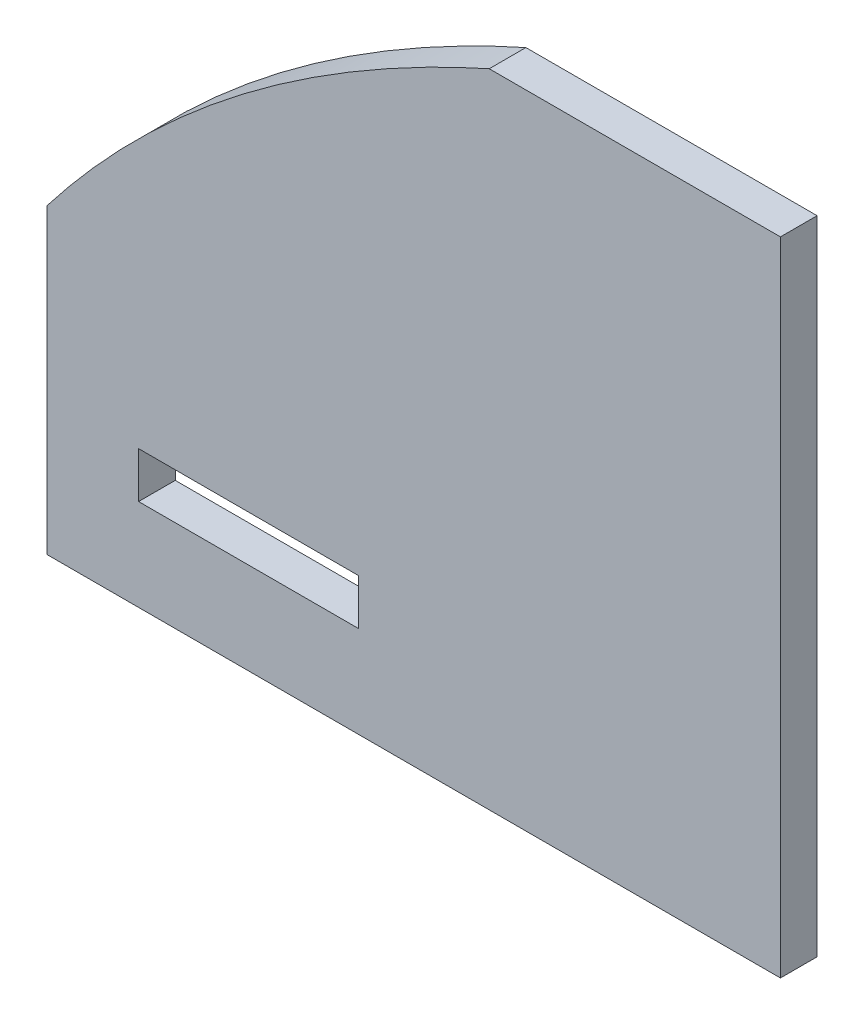
ISO-10303-21;
HEADER;
FILE_DESCRIPTION(('STEP AP214'),'2;1');
FILE_NAME('part.step','',(''),(''),'','','');
FILE_SCHEMA(('AUTOMOTIVE_DESIGN { 1 0 10303 214 1 1 1 1 }'));
ENDSEC;
DATA;
#1=APPLICATION_CONTEXT('core data for automotive mechanical design processes');
#2=APPLICATION_PROTOCOL_DEFINITION('international standard','automotive_design',2000,#1);
#3=PRODUCT_CONTEXT('',#1,'mechanical');
#4=PRODUCT('Part','Part','',(#3));
#5=PRODUCT_RELATED_PRODUCT_CATEGORY('part','',(#4));
#6=PRODUCT_DEFINITION_FORMATION('','',#4);
#7=PRODUCT_DEFINITION_CONTEXT('part definition',#1,'design');
#8=PRODUCT_DEFINITION('design','',#6,#7);
#9=PRODUCT_DEFINITION_SHAPE('','',#8);
#10=(LENGTH_UNIT() NAMED_UNIT(*) SI_UNIT(.MILLI.,.METRE.));
#11=(NAMED_UNIT(*) PLANE_ANGLE_UNIT() SI_UNIT($,.RADIAN.));
#12=(NAMED_UNIT(*) SI_UNIT($,.STERADIAN.) SOLID_ANGLE_UNIT());
#13=UNCERTAINTY_MEASURE_WITH_UNIT(LENGTH_MEASURE(1.E-05),#10,'distance_accuracy_value','');
#14=(GEOMETRIC_REPRESENTATION_CONTEXT(3) GLOBAL_UNCERTAINTY_ASSIGNED_CONTEXT((#13)) GLOBAL_UNIT_ASSIGNED_CONTEXT((#10,
#11,#12)) REPRESENTATION_CONTEXT('',''));
#15=CARTESIAN_POINT('',(0.,0.,0.));
#16=DIRECTION('',(0.,0.,1.));
#17=DIRECTION('',(1.,0.,0.));
#18=AXIS2_PLACEMENT_3D('',#15,#16,#17);
#19=CARTESIAN_POINT('',(0.,0.,2.));
#20=DIRECTION('',(0.,0.,-1.));
#21=DIRECTION('',(-1.,0.,0.));
#22=AXIS2_PLACEMENT_3D('',#19,#20,#21);
#23=PLANE('',#22);
#24=DIRECTION('',(-1.,0.,0.));
#25=VECTOR('',#24,1.);
#26=CARTESIAN_POINT('',(-20.,17.5,2.));
#27=LINE('',#26,#25);
#28=CARTESIAN_POINT('',(20.,17.5,2.));
#29=VERTEX_POINT('',#28);
#30=CARTESIAN_POINT('',(4.11999999999999,17.5,2.));
#31=VERTEX_POINT('',#30);
#32=EDGE_CURVE('E113',#29,#31,#27,.T.);
#33=ORIENTED_EDGE('',*,*,#32,.T.);
#34=CARTESIAN_POINT('',(-28.9974094779595,-17.6239337785056,2.));
#35=CARTESIAN_POINT('',(-20.2355041142434,6.58937083623082,2.));
#36=CARTESIAN_POINT('',(4.11999999999999,17.5,2.));
#37=B_SPLINE_CURVE_WITH_KNOTS('',2,(#34,#35,#36),.UNSPECIFIED.,.F.,.F.,(3,3),(0.,1.),.UNSPECIFIED.);
#38=CARTESIAN_POINT('',(-20.0000000003059,-1.030000000397,2.));
#39=VERTEX_POINT('',#38);
#40=EDGE_CURVE('E101',#39,#31,#37,.T.);
#41=ORIENTED_EDGE('',*,*,#40,.F.);
#42=DIRECTION('',(0.,-1.,0.));
#43=VECTOR('',#42,1.);
#44=CARTESIAN_POINT('',(-20.,-17.5,2.));
#45=LINE('',#44,#43);
#46=CARTESIAN_POINT('',(-20.,-17.5,2.));
#47=VERTEX_POINT('',#46);
#48=EDGE_CURVE('E121',#39,#47,#45,.T.);
#49=ORIENTED_EDGE('',*,*,#48,.T.);
#50=DIRECTION('',(1.,0.,0.));
#51=VECTOR('',#50,1.);
#52=CARTESIAN_POINT('',(-20.,-17.5,2.));
#53=LINE('',#52,#51);
#54=CARTESIAN_POINT('',(20.,-17.5,2.));
#55=VERTEX_POINT('',#54);
#56=EDGE_CURVE('E123',#47,#55,#53,.T.);
#57=ORIENTED_EDGE('',*,*,#56,.T.);
#58=DIRECTION('',(0.,1.,0.));
#59=VECTOR('',#58,1.);
#60=CARTESIAN_POINT('',(20.,-17.5,2.));
#61=LINE('',#60,#59);
#62=EDGE_CURVE('E119',#55,#29,#61,.T.);
#63=ORIENTED_EDGE('',*,*,#62,.T.);
#64=EDGE_LOOP('',(#33,#41,#49,#57,#63));
#65=FACE_BOUND('',#64,.T.);
#66=DIRECTION('',(0.,-1.,0.));
#67=VECTOR('',#66,1.);
#68=CARTESIAN_POINT('',(-15.,-12.5,2.));
#69=LINE('',#68,#67);
#70=CARTESIAN_POINT('',(-15.,-10.,2.));
#71=VERTEX_POINT('',#70);
#72=CARTESIAN_POINT('',(-15.,-12.5,2.));
#73=VERTEX_POINT('',#72);
#74=EDGE_CURVE('E159',#71,#73,#69,.T.);
#75=ORIENTED_EDGE('',*,*,#74,.F.);
#76=DIRECTION('',(-1.,0.,0.));
#77=VECTOR('',#76,1.);
#78=CARTESIAN_POINT('',(-15.,-10.,2.));
#79=LINE('',#78,#77);
#80=CARTESIAN_POINT('',(-3.,-10.,2.));
#81=VERTEX_POINT('',#80);
#82=EDGE_CURVE('E169',#81,#71,#79,.T.);
#83=ORIENTED_EDGE('',*,*,#82,.F.);
#84=DIRECTION('',(0.,1.,0.));
#85=VECTOR('',#84,1.);
#86=CARTESIAN_POINT('',(-3.,-12.5,2.));
#87=LINE('',#86,#85);
#88=CARTESIAN_POINT('',(-3.,-12.5,2.));
#89=VERTEX_POINT('',#88);
#90=EDGE_CURVE('E167',#89,#81,#87,.T.);
#91=ORIENTED_EDGE('',*,*,#90,.F.);
#92=DIRECTION('',(1.,0.,0.));
#93=VECTOR('',#92,1.);
#94=CARTESIAN_POINT('',(-15.,-12.5,2.));
#95=LINE('',#94,#93);
#96=EDGE_CURVE('E164',#73,#89,#95,.T.);
#97=ORIENTED_EDGE('',*,*,#96,.F.);
#98=EDGE_LOOP('',(#75,#83,#91,#97));
#99=FACE_BOUND('',#98,.T.);
#100=ADVANCED_FACE('F33',(#65,#99),#23,.F.);
#101=CARTESIAN_POINT('',(0.,0.,0.));
#102=DIRECTION('',(0.,0.,-1.));
#103=DIRECTION('',(-1.,0.,0.));
#104=AXIS2_PLACEMENT_3D('',#101,#102,#103);
#105=PLANE('',#104);
#106=CARTESIAN_POINT('',(-28.9974094779595,-17.6239337785056,0.));
#107=CARTESIAN_POINT('',(-20.2355041142434,6.58937083623082,0.));
#108=CARTESIAN_POINT('',(4.11999999999999,17.5,0.));
#109=B_SPLINE_CURVE_WITH_KNOTS('',2,(#106,#107,#108),.UNSPECIFIED.,.F.,.F.,(3,3),(0.,1.),.UNSPECIFIED.);
#110=CARTESIAN_POINT('',(4.11999999999999,17.5,0.));
#111=VERTEX_POINT('',#110);
#112=CARTESIAN_POINT('',(-20.,-1.03,0.));
#113=VERTEX_POINT('',#112);
#114=EDGE_CURVE('E48',#111,#113,#109,.F.);
#115=ORIENTED_EDGE('',*,*,#114,.F.);
#116=DIRECTION('',(-1.,0.,0.));
#117=VECTOR('',#116,1.);
#118=CARTESIAN_POINT('',(-20.,17.5,0.));
#119=LINE('',#118,#117);
#120=CARTESIAN_POINT('',(20.,17.5,0.));
#121=VERTEX_POINT('',#120);
#122=EDGE_CURVE('E115',#121,#111,#119,.T.);
#123=ORIENTED_EDGE('',*,*,#122,.F.);
#124=DIRECTION('',(0.,1.,0.));
#125=VECTOR('',#124,1.);
#126=CARTESIAN_POINT('',(20.,-17.5,0.));
#127=LINE('',#126,#125);
#128=CARTESIAN_POINT('',(20.,-17.5,0.));
#129=VERTEX_POINT('',#128);
#130=EDGE_CURVE('E131',#129,#121,#127,.T.);
#131=ORIENTED_EDGE('',*,*,#130,.F.);
#132=DIRECTION('',(1.,0.,0.));
#133=VECTOR('',#132,1.);
#134=CARTESIAN_POINT('',(-20.,-17.5,0.));
#135=LINE('',#134,#133);
#136=CARTESIAN_POINT('',(-20.,-17.5,0.));
#137=VERTEX_POINT('',#136);
#138=EDGE_CURVE('E125',#137,#129,#135,.T.);
#139=ORIENTED_EDGE('',*,*,#138,.F.);
#140=DIRECTION('',(0.,-1.,0.));
#141=VECTOR('',#140,1.);
#142=CARTESIAN_POINT('',(-20.,-17.5,0.));
#143=LINE('',#142,#141);
#144=EDGE_CURVE('E136',#113,#137,#143,.T.);
#145=ORIENTED_EDGE('',*,*,#144,.F.);
#146=EDGE_LOOP('',(#115,#123,#131,#139,#145));
#147=FACE_BOUND('',#146,.T.);
#148=DIRECTION('',(-1.,0.,0.));
#149=VECTOR('',#148,1.);
#150=CARTESIAN_POINT('',(-15.,-10.,0.));
#151=LINE('',#150,#149);
#152=CARTESIAN_POINT('',(-3.,-10.,0.));
#153=VERTEX_POINT('',#152);
#154=CARTESIAN_POINT('',(-15.,-10.,0.));
#155=VERTEX_POINT('',#154);
#156=EDGE_CURVE('E165',#153,#155,#151,.T.);
#157=ORIENTED_EDGE('',*,*,#156,.T.);
#158=DIRECTION('',(0.,-1.,0.));
#159=VECTOR('',#158,1.);
#160=CARTESIAN_POINT('',(-15.,-12.5,0.));
#161=LINE('',#160,#159);
#162=CARTESIAN_POINT('',(-15.,-12.5,0.));
#163=VERTEX_POINT('',#162);
#164=EDGE_CURVE('E151',#155,#163,#161,.T.);
#165=ORIENTED_EDGE('',*,*,#164,.T.);
#166=DIRECTION('',(1.,0.,0.));
#167=VECTOR('',#166,1.);
#168=CARTESIAN_POINT('',(-15.,-12.5,0.));
#169=LINE('',#168,#167);
#170=CARTESIAN_POINT('',(-3.,-12.5,0.));
#171=VERTEX_POINT('',#170);
#172=EDGE_CURVE('E154',#163,#171,#169,.T.);
#173=ORIENTED_EDGE('',*,*,#172,.T.);
#174=DIRECTION('',(0.,1.,0.));
#175=VECTOR('',#174,1.);
#176=CARTESIAN_POINT('',(-3.,-12.5,0.));
#177=LINE('',#176,#175);
#178=EDGE_CURVE('E174',#171,#153,#177,.T.);
#179=ORIENTED_EDGE('',*,*,#178,.T.);
#180=EDGE_LOOP('',(#157,#165,#173,#179));
#181=FACE_BOUND('',#180,.T.);
#182=ADVANCED_FACE('F148',(#147,#181),#105,.T.);
#183=CARTESIAN_POINT('',(20.,-17.5,2.));
#184=DIRECTION('',(-1.,0.,0.));
#185=DIRECTION('',(0.,0.,1.));
#186=AXIS2_PLACEMENT_3D('',#183,#184,#185);
#187=PLANE('',#186);
#188=ORIENTED_EDGE('',*,*,#130,.T.);
#189=DIRECTION('',(0.,0.,-1.));
#190=VECTOR('',#189,1.);
#191=CARTESIAN_POINT('',(20.,17.5,2.));
#192=LINE('',#191,#190);
#193=EDGE_CURVE('E41',#29,#121,#192,.T.);
#194=ORIENTED_EDGE('',*,*,#193,.F.);
#195=ORIENTED_EDGE('',*,*,#62,.F.);
#196=DIRECTION('',(0.,0.,-1.));
#197=VECTOR('',#196,1.);
#198=CARTESIAN_POINT('',(20.,-17.5,2.));
#199=LINE('',#198,#197);
#200=EDGE_CURVE('E130',#55,#129,#199,.T.);
#201=ORIENTED_EDGE('',*,*,#200,.T.);
#202=EDGE_LOOP('',(#188,#194,#195,#201));
#203=FACE_BOUND('',#202,.T.);
#204=ADVANCED_FACE('F35',(#203),#187,.F.);
#205=CARTESIAN_POINT('',(-20.,17.5,2.));
#206=DIRECTION('',(0.,-1.,0.));
#207=DIRECTION('',(0.,0.,-1.));
#208=AXIS2_PLACEMENT_3D('',#205,#206,#207);
#209=PLANE('',#208);
#210=ORIENTED_EDGE('',*,*,#122,.T.);
#211=DIRECTION('',(0.,0.,1.));
#212=VECTOR('',#211,1.);
#213=CARTESIAN_POINT('',(4.11999999999999,17.5,-8.));
#214=LINE('',#213,#212);
#215=EDGE_CURVE('E104',#111,#31,#214,.T.);
#216=ORIENTED_EDGE('',*,*,#215,.T.);
#217=ORIENTED_EDGE('',*,*,#32,.F.);
#218=ORIENTED_EDGE('',*,*,#193,.T.);
#219=EDGE_LOOP('',(#210,#216,#217,#218));
#220=FACE_BOUND('',#219,.T.);
#221=ADVANCED_FACE('F111',(#220),#209,.F.);
#222=CARTESIAN_POINT('',(-20.,-17.5,2.));
#223=DIRECTION('',(1.,0.,0.));
#224=DIRECTION('',(0.,0.,-1.));
#225=AXIS2_PLACEMENT_3D('',#222,#223,#224);
#226=PLANE('',#225);
#227=ORIENTED_EDGE('',*,*,#48,.F.);
#228=DIRECTION('',(0.,0.,1.));
#229=VECTOR('',#228,1.);
#230=CARTESIAN_POINT('',(-20.,-1.03,-8.));
#231=LINE('',#230,#229);
#232=EDGE_CURVE('E11',#39,#113,#231,.F.);
#233=ORIENTED_EDGE('',*,*,#232,.T.);
#234=ORIENTED_EDGE('',*,*,#144,.T.);
#235=DIRECTION('',(0.,0.,-1.));
#236=VECTOR('',#235,1.);
#237=CARTESIAN_POINT('',(-20.,-17.5,2.));
#238=LINE('',#237,#236);
#239=EDGE_CURVE('E141',#47,#137,#238,.T.);
#240=ORIENTED_EDGE('',*,*,#239,.F.);
#241=EDGE_LOOP('',(#227,#233,#234,#240));
#242=FACE_BOUND('',#241,.T.);
#243=ADVANCED_FACE('F218',(#242),#226,.F.);
#244=CARTESIAN_POINT('',(-20.,-17.5,2.));
#245=DIRECTION('',(0.,1.,0.));
#246=DIRECTION('',(0.,0.,1.));
#247=AXIS2_PLACEMENT_3D('',#244,#245,#246);
#248=PLANE('',#247);
#249=ORIENTED_EDGE('',*,*,#138,.T.);
#250=ORIENTED_EDGE('',*,*,#200,.F.);
#251=ORIENTED_EDGE('',*,*,#56,.F.);
#252=ORIENTED_EDGE('',*,*,#239,.T.);
#253=EDGE_LOOP('',(#249,#250,#251,#252));
#254=FACE_BOUND('',#253,.T.);
#255=ADVANCED_FACE('F215',(#254),#248,.F.);
#256=CARTESIAN_POINT('',(-15.,-12.5,2.));
#257=DIRECTION('',(1.,0.,0.));
#258=DIRECTION('',(0.,0.,-1.));
#259=AXIS2_PLACEMENT_3D('',#256,#257,#258);
#260=PLANE('',#259);
#261=ORIENTED_EDGE('',*,*,#164,.F.);
#262=DIRECTION('',(0.,0.,-1.));
#263=VECTOR('',#262,1.);
#264=CARTESIAN_POINT('',(-15.,-10.,2.));
#265=LINE('',#264,#263);
#266=EDGE_CURVE('E170',#71,#155,#265,.T.);
#267=ORIENTED_EDGE('',*,*,#266,.F.);
#268=ORIENTED_EDGE('',*,*,#74,.T.);
#269=DIRECTION('',(0.,0.,-1.));
#270=VECTOR('',#269,1.);
#271=CARTESIAN_POINT('',(-15.,-12.5,2.));
#272=LINE('',#271,#270);
#273=EDGE_CURVE('E134',#73,#163,#272,.T.);
#274=ORIENTED_EDGE('',*,*,#273,.T.);
#275=EDGE_LOOP('',(#261,#267,#268,#274));
#276=FACE_BOUND('',#275,.T.);
#277=ADVANCED_FACE('F186',(#276),#260,.T.);
#278=CARTESIAN_POINT('',(-15.,-12.5,2.));
#279=DIRECTION('',(0.,1.,0.));
#280=DIRECTION('',(0.,0.,1.));
#281=AXIS2_PLACEMENT_3D('',#278,#279,#280);
#282=PLANE('',#281);
#283=ORIENTED_EDGE('',*,*,#172,.F.);
#284=ORIENTED_EDGE('',*,*,#273,.F.);
#285=ORIENTED_EDGE('',*,*,#96,.T.);
#286=DIRECTION('',(0.,0.,-1.));
#287=VECTOR('',#286,1.);
#288=CARTESIAN_POINT('',(-3.,-12.5,2.));
#289=LINE('',#288,#287);
#290=EDGE_CURVE('E182',#89,#171,#289,.T.);
#291=ORIENTED_EDGE('',*,*,#290,.T.);
#292=EDGE_LOOP('',(#283,#284,#285,#291));
#293=FACE_BOUND('',#292,.T.);
#294=ADVANCED_FACE('F196',(#293),#282,.T.);
#295=CARTESIAN_POINT('',(-3.,-12.5,2.));
#296=DIRECTION('',(-1.,0.,0.));
#297=DIRECTION('',(0.,0.,1.));
#298=AXIS2_PLACEMENT_3D('',#295,#296,#297);
#299=PLANE('',#298);
#300=ORIENTED_EDGE('',*,*,#178,.F.);
#301=ORIENTED_EDGE('',*,*,#290,.F.);
#302=ORIENTED_EDGE('',*,*,#90,.T.);
#303=DIRECTION('',(0.,0.,-1.));
#304=VECTOR('',#303,1.);
#305=CARTESIAN_POINT('',(-3.,-10.,2.));
#306=LINE('',#305,#304);
#307=EDGE_CURVE('E55',#81,#153,#306,.T.);
#308=ORIENTED_EDGE('',*,*,#307,.T.);
#309=EDGE_LOOP('',(#300,#301,#302,#308));
#310=FACE_BOUND('',#309,.T.);
#311=ADVANCED_FACE('F198',(#310),#299,.T.);
#312=CARTESIAN_POINT('',(-15.,-10.,2.));
#313=DIRECTION('',(0.,-1.,0.));
#314=DIRECTION('',(0.,0.,-1.));
#315=AXIS2_PLACEMENT_3D('',#312,#313,#314);
#316=PLANE('',#315);
#317=ORIENTED_EDGE('',*,*,#156,.F.);
#318=ORIENTED_EDGE('',*,*,#307,.F.);
#319=ORIENTED_EDGE('',*,*,#82,.T.);
#320=ORIENTED_EDGE('',*,*,#266,.T.);
#321=EDGE_LOOP('',(#317,#318,#319,#320));
#322=FACE_BOUND('',#321,.T.);
#323=ADVANCED_FACE('F192',(#322),#316,.T.);
#324=CARTESIAN_POINT('',(-28.9974094779595,-17.6239337785056,-8.));
#325=CARTESIAN_POINT('',(-20.2355041142434,6.58937083623082,-8.));
#326=CARTESIAN_POINT('',(4.11999999999999,17.5,-8.));
#327=B_SPLINE_CURVE_WITH_KNOTS('',2,(#324,#325,#326),.UNSPECIFIED.,.F.,.F.,(3,3),(0.,1.),.UNSPECIFIED.);
#328=DIRECTION('',(0.,0.,1.));
#329=VECTOR('',#328,1.);
#330=SURFACE_OF_LINEAR_EXTRUSION('',#327,#329);
#331=ORIENTED_EDGE('',*,*,#114,.T.);
#332=ORIENTED_EDGE('',*,*,#232,.F.);
#333=ORIENTED_EDGE('',*,*,#40,.T.);
#334=ORIENTED_EDGE('',*,*,#215,.F.);
#335=EDGE_LOOP('',(#331,#332,#333,#334));
#336=FACE_BOUND('',#335,.T.);
#337=ADVANCED_FACE('F103',(#336),#330,.F.);
#338=CLOSED_SHELL('',(#100,#182,#204,#221,#243,#255,#277,#294,#311,#323,#337));
#339=MANIFOLD_SOLID_BREP('B2',#338);
#340=ADVANCED_BREP_SHAPE_REPRESENTATION('',(#18,#339),#14);
#341=SHAPE_DEFINITION_REPRESENTATION(#9,#340);
ENDSEC;
END-ISO-10303-21;
